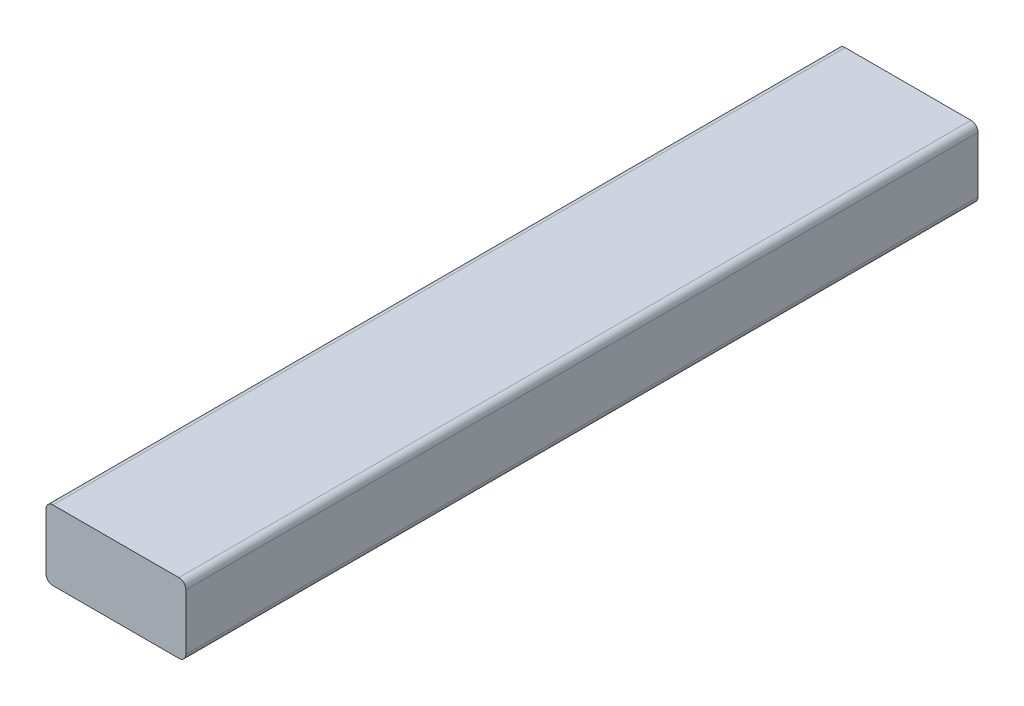
ISO-10303-21;
HEADER;
FILE_DESCRIPTION(('STEP AP214'),'2;1');
FILE_NAME('part.step','',(''),(''),'','','');
FILE_SCHEMA(('AUTOMOTIVE_DESIGN { 1 0 10303 214 1 1 1 1 }'));
ENDSEC;
DATA;
#1=APPLICATION_CONTEXT('core data for automotive mechanical design processes');
#2=APPLICATION_PROTOCOL_DEFINITION('international standard','automotive_design',2000,#1);
#3=PRODUCT_CONTEXT('',#1,'mechanical');
#4=PRODUCT('Part','Part','',(#3));
#5=PRODUCT_RELATED_PRODUCT_CATEGORY('part','',(#4));
#6=PRODUCT_DEFINITION_FORMATION('','',#4);
#7=PRODUCT_DEFINITION_CONTEXT('part definition',#1,'design');
#8=PRODUCT_DEFINITION('design','',#6,#7);
#9=PRODUCT_DEFINITION_SHAPE('','',#8);
#10=(LENGTH_UNIT() NAMED_UNIT(*) SI_UNIT(.MILLI.,.METRE.));
#11=(NAMED_UNIT(*) PLANE_ANGLE_UNIT() SI_UNIT($,.RADIAN.));
#12=(NAMED_UNIT(*) SI_UNIT($,.STERADIAN.) SOLID_ANGLE_UNIT());
#13=UNCERTAINTY_MEASURE_WITH_UNIT(LENGTH_MEASURE(1.E-05),#10,'distance_accuracy_value','');
#14=(GEOMETRIC_REPRESENTATION_CONTEXT(3) GLOBAL_UNCERTAINTY_ASSIGNED_CONTEXT((#13)) GLOBAL_UNIT_ASSIGNED_CONTEXT((#10,
#11,#12)) REPRESENTATION_CONTEXT('',''));
#15=CARTESIAN_POINT('',(0.,0.,0.));
#16=DIRECTION('',(0.,0.,1.));
#17=DIRECTION('',(1.,0.,0.));
#18=AXIS2_PLACEMENT_3D('',#15,#16,#17);
#19=CARTESIAN_POINT('',(0.,5.3444781408848E-12,287.699999999991));
#20=DIRECTION('',(0.,0.,-1.));
#21=DIRECTION('',(0.,1.,0.));
#22=AXIS2_PLACEMENT_3D('',#19,#20,#21);
#23=PLANE('',#22);
#24=DIRECTION('',(0.,1.,0.));
#25=VECTOR('',#24,1.);
#26=CARTESIAN_POINT('',(2612.69999999996,38.1000000000108,287.69999999999));
#27=LINE('',#26,#25);
#28=CARTESIAN_POINT('',(2612.69999999996,-7.61999999998973,287.699999999991));
#29=VERTEX_POINT('',#28);
#30=CARTESIAN_POINT('',(2612.69999999996,33.0200000000108,287.69999999999));
#31=VERTEX_POINT('',#30);
#32=EDGE_CURVE('E117',#29,#31,#27,.T.);
#33=ORIENTED_EDGE('',*,*,#32,.F.);
#34=CARTESIAN_POINT('',(2617.77999999996,-7.61999999998972,287.699999999991));
#35=DIRECTION('',(0.,0.,-1.));
#36=DIRECTION('',(0.,1.,0.));
#37=AXIS2_PLACEMENT_3D('',#34,#35,#36);
#38=CIRCLE('',#37,5.08);
#39=CARTESIAN_POINT('',(2617.77999999996,-12.6999999999897,287.699999999991));
#40=VERTEX_POINT('',#39);
#41=EDGE_CURVE('E189',#29,#40,#38,.F.);
#42=ORIENTED_EDGE('',*,*,#41,.T.);
#43=DIRECTION('',(-1.,0.,0.));
#44=VECTOR('',#43,1.);
#45=CARTESIAN_POINT('',(2714.29999999996,-12.6999999999897,287.699999999991));
#46=LINE('',#45,#44);
#47=CARTESIAN_POINT('',(2709.21999999996,-12.6999999999897,287.699999999991));
#48=VERTEX_POINT('',#47);
#49=EDGE_CURVE('E165',#48,#40,#46,.T.);
#50=ORIENTED_EDGE('',*,*,#49,.F.);
#51=CARTESIAN_POINT('',(2709.21999999996,-7.61999999998973,287.699999999991));
#52=DIRECTION('',(0.,0.,-1.));
#53=DIRECTION('',(0.,1.,0.));
#54=AXIS2_PLACEMENT_3D('',#51,#52,#53);
#55=CIRCLE('',#54,5.08);
#56=CARTESIAN_POINT('',(2714.29999999996,-7.61999999998973,287.699999999991));
#57=VERTEX_POINT('',#56);
#58=EDGE_CURVE('E163',#48,#57,#55,.F.);
#59=ORIENTED_EDGE('',*,*,#58,.T.);
#60=DIRECTION('',(0.,-1.,0.));
#61=VECTOR('',#60,1.);
#62=CARTESIAN_POINT('',(2714.29999999996,38.1000000000108,287.69999999999));
#63=LINE('',#62,#61);
#64=CARTESIAN_POINT('',(2714.29999999996,33.0200000000108,287.69999999999));
#65=VERTEX_POINT('',#64);
#66=EDGE_CURVE('E156',#65,#57,#63,.T.);
#67=ORIENTED_EDGE('',*,*,#66,.F.);
#68=CARTESIAN_POINT('',(2709.21999999996,33.0200000000108,287.69999999999));
#69=DIRECTION('',(0.,0.,-1.));
#70=DIRECTION('',(0.,1.,0.));
#71=AXIS2_PLACEMENT_3D('',#68,#69,#70);
#72=CIRCLE('',#71,5.08);
#73=CARTESIAN_POINT('',(2709.21999999996,38.1000000000108,287.69999999999));
#74=VERTEX_POINT('',#73);
#75=EDGE_CURVE('E160',#65,#74,#72,.F.);
#76=ORIENTED_EDGE('',*,*,#75,.T.);
#77=DIRECTION('',(1.,0.,0.));
#78=VECTOR('',#77,1.);
#79=CARTESIAN_POINT('',(2714.29999999996,38.1000000000108,287.69999999999));
#80=LINE('',#79,#78);
#81=CARTESIAN_POINT('',(2617.77999999996,38.1000000000108,287.69999999999));
#82=VERTEX_POINT('',#81);
#83=EDGE_CURVE('E175',#82,#74,#80,.T.);
#84=ORIENTED_EDGE('',*,*,#83,.F.);
#85=CARTESIAN_POINT('',(2617.77999999996,33.0200000000108,287.69999999999));
#86=DIRECTION('',(0.,0.,-1.));
#87=DIRECTION('',(0.,1.,0.));
#88=AXIS2_PLACEMENT_3D('',#85,#86,#87);
#89=CIRCLE('',#88,5.08);
#90=EDGE_CURVE('E186',#82,#31,#89,.F.);
#91=ORIENTED_EDGE('',*,*,#90,.T.);
#92=EDGE_LOOP('',(#33,#42,#50,#59,#67,#76,#84,#91));
#93=FACE_BOUND('',#92,.T.);
#94=ADVANCED_FACE('F43',(#93),#23,.F.);
#95=CARTESIAN_POINT('',(2714.29999999996,38.0999999999983,-401.292253256991));
#96=DIRECTION('',(0.,-1.,0.));
#97=DIRECTION('',(0.,0.,-1.));
#98=AXIS2_PLACEMENT_3D('',#95,#96,#97);
#99=PLANE('',#98);
#100=DIRECTION('',(-1.,0.,0.));
#101=VECTOR('',#100,1.);
#102=CARTESIAN_POINT('',(2714.29999999996,38.1000000000004,-287.700000000002));
#103=LINE('',#102,#101);
#104=CARTESIAN_POINT('',(2709.21999999996,38.1000000000004,-287.700000000002));
#105=VERTEX_POINT('',#104);
#106=CARTESIAN_POINT('',(2617.77999999996,38.1000000000004,-287.700000000002));
#107=VERTEX_POINT('',#106);
#108=EDGE_CURVE('E132',#105,#107,#103,.T.);
#109=ORIENTED_EDGE('',*,*,#108,.T.);
#110=DIRECTION('',(0.,0.,1.));
#111=VECTOR('',#110,1.);
#112=CARTESIAN_POINT('',(2617.77999999996,38.0999999999983,-401.292253256991));
#113=LINE('',#112,#111);
#114=EDGE_CURVE('E137',#107,#82,#113,.T.);
#115=ORIENTED_EDGE('',*,*,#114,.T.);
#116=ORIENTED_EDGE('',*,*,#83,.T.);
#117=DIRECTION('',(0.,0.,1.));
#118=VECTOR('',#117,1.);
#119=CARTESIAN_POINT('',(2709.21999999996,38.0999999999983,-401.292253256991));
#120=LINE('',#119,#118);
#121=EDGE_CURVE('E143',#74,#105,#120,.F.);
#122=ORIENTED_EDGE('',*,*,#121,.T.);
#123=EDGE_LOOP('',(#109,#115,#116,#122));
#124=FACE_BOUND('',#123,.T.);
#125=ADVANCED_FACE('F217',(#124),#99,.F.);
#126=CARTESIAN_POINT('',(2612.69999999996,38.0999999999983,-401.292253256991));
#127=DIRECTION('',(1.,0.,0.));
#128=DIRECTION('',(0.,0.,-1.));
#129=AXIS2_PLACEMENT_3D('',#126,#127,#128);
#130=PLANE('',#129);
#131=DIRECTION('',(0.,-1.,0.));
#132=VECTOR('',#131,1.);
#133=CARTESIAN_POINT('',(2612.69999999996,38.1000000000004,-287.700000000002));
#134=LINE('',#133,#132);
#135=CARTESIAN_POINT('',(2612.69999999996,33.0200000000004,-287.700000000002));
#136=VERTEX_POINT('',#135);
#137=CARTESIAN_POINT('',(2612.69999999996,-7.62000000000013,-287.700000000001));
#138=VERTEX_POINT('',#137);
#139=EDGE_CURVE('E114',#136,#138,#134,.T.);
#140=ORIENTED_EDGE('',*,*,#139,.T.);
#141=DIRECTION('',(0.,0.,1.));
#142=VECTOR('',#141,1.);
#143=CARTESIAN_POINT('',(2612.69999999996,-7.62000000000218,-401.29225325699));
#144=LINE('',#143,#142);
#145=EDGE_CURVE('E121',#138,#29,#144,.T.);
#146=ORIENTED_EDGE('',*,*,#145,.T.);
#147=ORIENTED_EDGE('',*,*,#32,.T.);
#148=DIRECTION('',(0.,0.,1.));
#149=VECTOR('',#148,1.);
#150=CARTESIAN_POINT('',(2612.69999999996,33.0199999999983,-401.292253256991));
#151=LINE('',#150,#149);
#152=EDGE_CURVE('E110',#31,#136,#151,.F.);
#153=ORIENTED_EDGE('',*,*,#152,.T.);
#154=EDGE_LOOP('',(#140,#146,#147,#153));
#155=FACE_BOUND('',#154,.T.);
#156=ADVANCED_FACE('F112',(#155),#130,.F.);
#157=CARTESIAN_POINT('',(2714.29999999996,-12.7000000000022,-401.29225325699));
#158=DIRECTION('',(0.,1.,0.));
#159=DIRECTION('',(0.,0.,1.));
#160=AXIS2_PLACEMENT_3D('',#157,#158,#159);
#161=PLANE('',#160);
#162=ORIENTED_EDGE('',*,*,#49,.T.);
#163=DIRECTION('',(0.,0.,1.));
#164=VECTOR('',#163,1.);
#165=CARTESIAN_POINT('',(2617.77999999996,-12.7000000000022,-401.29225325699));
#166=LINE('',#165,#164);
#167=CARTESIAN_POINT('',(2617.77999999996,-12.7000000000001,-287.700000000001));
#168=VERTEX_POINT('',#167);
#169=EDGE_CURVE('E196',#40,#168,#166,.F.);
#170=ORIENTED_EDGE('',*,*,#169,.T.);
#171=DIRECTION('',(1.,0.,0.));
#172=VECTOR('',#171,1.);
#173=CARTESIAN_POINT('',(2714.29999999996,-12.7000000000001,-287.700000000001));
#174=LINE('',#173,#172);
#175=CARTESIAN_POINT('',(2709.21999999996,-12.7000000000001,-287.700000000001));
#176=VERTEX_POINT('',#175);
#177=EDGE_CURVE('E131',#168,#176,#174,.T.);
#178=ORIENTED_EDGE('',*,*,#177,.T.);
#179=DIRECTION('',(0.,0.,1.));
#180=VECTOR('',#179,1.);
#181=CARTESIAN_POINT('',(2709.21999999996,-12.7000000000022,-401.29225325699));
#182=LINE('',#181,#180);
#183=EDGE_CURVE('E192',#176,#48,#182,.T.);
#184=ORIENTED_EDGE('',*,*,#183,.T.);
#185=EDGE_LOOP('',(#162,#170,#178,#184));
#186=FACE_BOUND('',#185,.T.);
#187=ADVANCED_FACE('F204',(#186),#161,.F.);
#188=CARTESIAN_POINT('',(2714.29999999996,38.0999999999983,-401.292253256991));
#189=DIRECTION('',(-1.,0.,0.));
#190=DIRECTION('',(0.,0.,1.));
#191=AXIS2_PLACEMENT_3D('',#188,#189,#190);
#192=PLANE('',#191);
#193=ORIENTED_EDGE('',*,*,#66,.T.);
#194=DIRECTION('',(0.,0.,1.));
#195=VECTOR('',#194,1.);
#196=CARTESIAN_POINT('',(2714.29999999996,-7.62000000000219,-401.29225325699));
#197=LINE('',#196,#195);
#198=CARTESIAN_POINT('',(2714.29999999996,-7.62000000000013,-287.700000000001));
#199=VERTEX_POINT('',#198);
#200=EDGE_CURVE('E11',#57,#199,#197,.F.);
#201=ORIENTED_EDGE('',*,*,#200,.T.);
#202=DIRECTION('',(0.,1.,0.));
#203=VECTOR('',#202,1.);
#204=CARTESIAN_POINT('',(2714.29999999996,38.1000000000004,-287.700000000002));
#205=LINE('',#204,#203);
#206=CARTESIAN_POINT('',(2714.29999999996,33.0200000000004,-287.700000000002));
#207=VERTEX_POINT('',#206);
#208=EDGE_CURVE('E122',#199,#207,#205,.T.);
#209=ORIENTED_EDGE('',*,*,#208,.T.);
#210=DIRECTION('',(0.,0.,1.));
#211=VECTOR('',#210,1.);
#212=CARTESIAN_POINT('',(2714.29999999996,33.0199999999983,-401.292253256991));
#213=LINE('',#212,#211);
#214=EDGE_CURVE('E52',#207,#65,#213,.T.);
#215=ORIENTED_EDGE('',*,*,#214,.T.);
#216=EDGE_LOOP('',(#193,#201,#209,#215));
#217=FACE_BOUND('',#216,.T.);
#218=ADVANCED_FACE('F155',(#217),#192,.F.);
#219=CARTESIAN_POINT('',(2714.29999999996,38.1000000000004,-287.700000000002));
#220=DIRECTION('',(0.,0.,1.));
#221=DIRECTION('',(0.,-1.,0.));
#222=AXIS2_PLACEMENT_3D('',#219,#220,#221);
#223=PLANE('',#222);
#224=ORIENTED_EDGE('',*,*,#177,.F.);
#225=CARTESIAN_POINT('',(2617.77999999996,-7.62000000000013,-287.700000000001));
#226=DIRECTION('',(0.,0.,1.));
#227=DIRECTION('',(0.,-1.,0.));
#228=AXIS2_PLACEMENT_3D('',#225,#226,#227);
#229=CIRCLE('',#228,5.08);
#230=EDGE_CURVE('E129',#168,#138,#229,.F.);
#231=ORIENTED_EDGE('',*,*,#230,.T.);
#232=ORIENTED_EDGE('',*,*,#139,.F.);
#233=CARTESIAN_POINT('',(2617.77999999996,33.0200000000004,-287.700000000002));
#234=DIRECTION('',(0.,0.,1.));
#235=DIRECTION('',(0.,-1.,0.));
#236=AXIS2_PLACEMENT_3D('',#233,#234,#235);
#237=CIRCLE('',#236,5.08);
#238=EDGE_CURVE('E126',#136,#107,#237,.F.);
#239=ORIENTED_EDGE('',*,*,#238,.T.);
#240=ORIENTED_EDGE('',*,*,#108,.F.);
#241=CARTESIAN_POINT('',(2709.21999999996,33.0200000000004,-287.700000000002));
#242=DIRECTION('',(0.,0.,1.));
#243=DIRECTION('',(0.,-1.,0.));
#244=AXIS2_PLACEMENT_3D('',#241,#242,#243);
#245=CIRCLE('',#244,5.08);
#246=EDGE_CURVE('E59',#105,#207,#245,.F.);
#247=ORIENTED_EDGE('',*,*,#246,.T.);
#248=ORIENTED_EDGE('',*,*,#208,.F.);
#249=CARTESIAN_POINT('',(2709.21999999996,-7.62000000000013,-287.700000000001));
#250=DIRECTION('',(0.,0.,1.));
#251=DIRECTION('',(0.,-1.,0.));
#252=AXIS2_PLACEMENT_3D('',#249,#250,#251);
#253=CIRCLE('',#252,5.08);
#254=EDGE_CURVE('E139',#199,#176,#253,.F.);
#255=ORIENTED_EDGE('',*,*,#254,.T.);
#256=EDGE_LOOP('',(#224,#231,#232,#239,#240,#247,#248,#255));
#257=FACE_BOUND('',#256,.T.);
#258=ADVANCED_FACE('F125',(#257),#223,.F.);
#259=CARTESIAN_POINT('',(2617.77999999996,-7.62000000000218,-401.29225325699));
#260=DIRECTION('',(0.,0.,1.));
#261=DIRECTION('',(0.,-1.,0.));
#262=AXIS2_PLACEMENT_3D('',#259,#260,#261);
#263=CYLINDRICAL_SURFACE('',#262,5.08);
#264=ORIENTED_EDGE('',*,*,#230,.F.);
#265=ORIENTED_EDGE('',*,*,#169,.F.);
#266=ORIENTED_EDGE('',*,*,#41,.F.);
#267=ORIENTED_EDGE('',*,*,#145,.F.);
#268=EDGE_LOOP('',(#264,#265,#266,#267));
#269=FACE_BOUND('',#268,.T.);
#270=ADVANCED_FACE('F214',(#269),#263,.T.);
#271=CARTESIAN_POINT('',(2617.77999999996,33.0199999999983,-401.292253256991));
#272=DIRECTION('',(0.,0.,1.));
#273=DIRECTION('',(0.,-1.,0.));
#274=AXIS2_PLACEMENT_3D('',#271,#272,#273);
#275=CYLINDRICAL_SURFACE('',#274,5.08);
#276=ORIENTED_EDGE('',*,*,#238,.F.);
#277=ORIENTED_EDGE('',*,*,#152,.F.);
#278=ORIENTED_EDGE('',*,*,#90,.F.);
#279=ORIENTED_EDGE('',*,*,#114,.F.);
#280=EDGE_LOOP('',(#276,#277,#278,#279));
#281=FACE_BOUND('',#280,.T.);
#282=ADVANCED_FACE('F135',(#281),#275,.T.);
#283=CARTESIAN_POINT('',(2709.21999999996,-7.62000000000219,-401.29225325699));
#284=DIRECTION('',(0.,0.,1.));
#285=DIRECTION('',(0.,-1.,0.));
#286=AXIS2_PLACEMENT_3D('',#283,#284,#285);
#287=CYLINDRICAL_SURFACE('',#286,5.08);
#288=ORIENTED_EDGE('',*,*,#254,.F.);
#289=ORIENTED_EDGE('',*,*,#200,.F.);
#290=ORIENTED_EDGE('',*,*,#58,.F.);
#291=ORIENTED_EDGE('',*,*,#183,.F.);
#292=EDGE_LOOP('',(#288,#289,#290,#291));
#293=FACE_BOUND('',#292,.T.);
#294=ADVANCED_FACE('F208',(#293),#287,.T.);
#295=CARTESIAN_POINT('',(2709.21999999996,33.0199999999983,-401.292253256991));
#296=DIRECTION('',(0.,0.,1.));
#297=DIRECTION('',(0.,-1.,0.));
#298=AXIS2_PLACEMENT_3D('',#295,#296,#297);
#299=CYLINDRICAL_SURFACE('',#298,5.08);
#300=ORIENTED_EDGE('',*,*,#246,.F.);
#301=ORIENTED_EDGE('',*,*,#121,.F.);
#302=ORIENTED_EDGE('',*,*,#75,.F.);
#303=ORIENTED_EDGE('',*,*,#214,.F.);
#304=EDGE_LOOP('',(#300,#301,#302,#303));
#305=FACE_BOUND('',#304,.T.);
#306=ADVANCED_FACE('F45',(#305),#299,.T.);
#307=CLOSED_SHELL('',(#94,#125,#156,#187,#218,#258,#270,#282,#294,#306));
#308=MANIFOLD_SOLID_BREP('B2',#307);
#309=ADVANCED_BREP_SHAPE_REPRESENTATION('',(#18,#308),#14);
#310=SHAPE_DEFINITION_REPRESENTATION(#9,#309);
ENDSEC;
END-ISO-10303-21;
